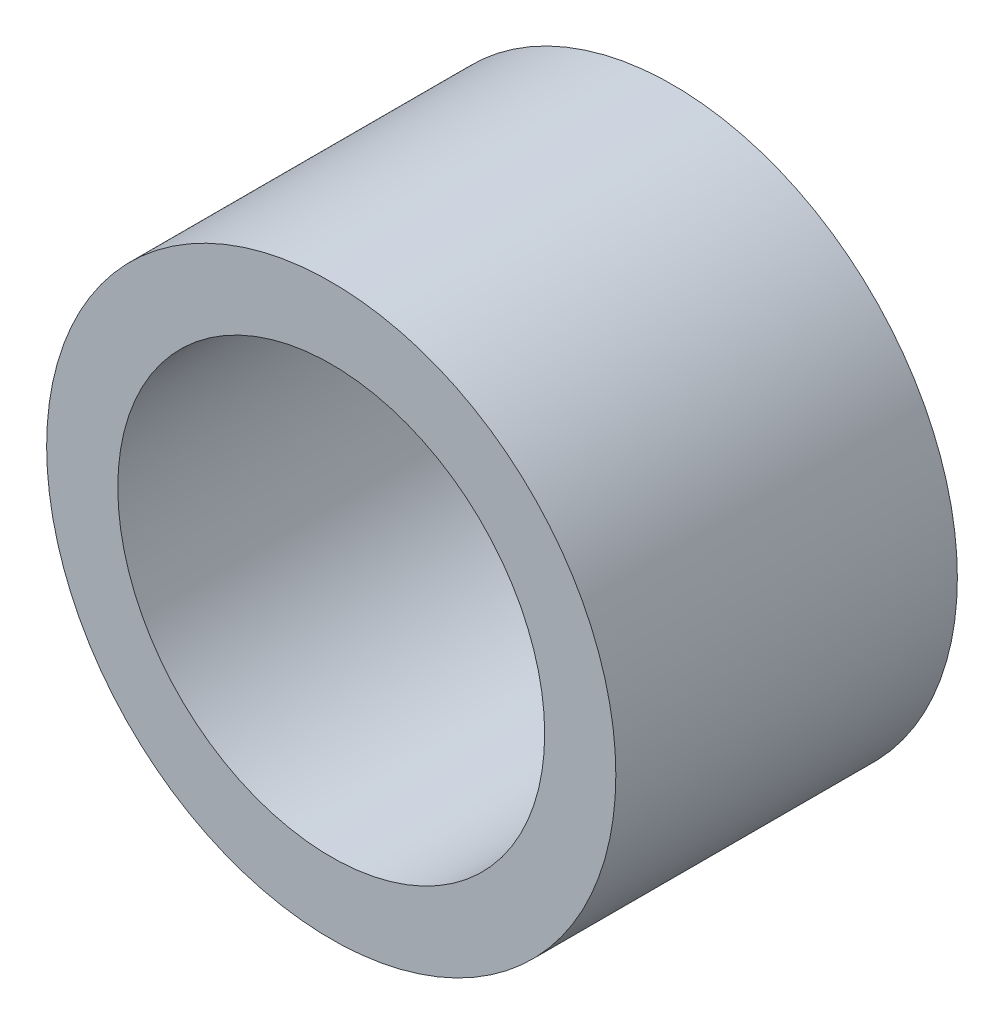
ISO-10303-21;
HEADER;
FILE_DESCRIPTION(('STEP AP214'),'2;1');
FILE_NAME('part.step','',(''),(''),'','','');
FILE_SCHEMA(('AUTOMOTIVE_DESIGN { 1 0 10303 214 1 1 1 1 }'));
ENDSEC;
DATA;
#1=APPLICATION_CONTEXT('core data for automotive mechanical design processes');
#2=APPLICATION_PROTOCOL_DEFINITION('international standard','automotive_design',2000,#1);
#3=PRODUCT_CONTEXT('',#1,'mechanical');
#4=PRODUCT('Part','Part','',(#3));
#5=PRODUCT_RELATED_PRODUCT_CATEGORY('part','',(#4));
#6=PRODUCT_DEFINITION_FORMATION('','',#4);
#7=PRODUCT_DEFINITION_CONTEXT('part definition',#1,'design');
#8=PRODUCT_DEFINITION('design','',#6,#7);
#9=PRODUCT_DEFINITION_SHAPE('','',#8);
#10=(LENGTH_UNIT() NAMED_UNIT(*) SI_UNIT(.MILLI.,.METRE.));
#11=(NAMED_UNIT(*) PLANE_ANGLE_UNIT() SI_UNIT($,.RADIAN.));
#12=(NAMED_UNIT(*) SI_UNIT($,.STERADIAN.) SOLID_ANGLE_UNIT());
#13=UNCERTAINTY_MEASURE_WITH_UNIT(LENGTH_MEASURE(1.E-05),#10,'distance_accuracy_value','');
#14=(GEOMETRIC_REPRESENTATION_CONTEXT(3) GLOBAL_UNCERTAINTY_ASSIGNED_CONTEXT((#13)) GLOBAL_UNIT_ASSIGNED_CONTEXT((#10,
#11,#12)) REPRESENTATION_CONTEXT('',''));
#15=CARTESIAN_POINT('',(0.,0.,0.));
#16=DIRECTION('',(0.,0.,1.));
#17=DIRECTION('',(1.,0.,0.));
#18=AXIS2_PLACEMENT_3D('',#15,#16,#17);
#19=CARTESIAN_POINT('',(0.,0.,5.08));
#20=DIRECTION('',(0.,0.,1.));
#21=DIRECTION('',(1.,0.,0.));
#22=AXIS2_PLACEMENT_3D('',#19,#20,#21);
#23=PLANE('',#22);
#24=CARTESIAN_POINT('',(0.,0.,5.08));
#25=DIRECTION('',(0.,0.,1.));
#26=DIRECTION('',(1.,0.,0.));
#27=AXIS2_PLACEMENT_3D('',#24,#25,#26);
#28=CIRCLE('',#27,4.23333333333333);
#29=CARTESIAN_POINT('',(4.23333333333333,0.,5.08));
#30=VERTEX_POINT('',#29);
#31=EDGE_CURVE('E10',#30,#30,#28,.T.);
#32=ORIENTED_EDGE('',*,*,#31,.T.);
#33=EDGE_LOOP('',(#32));
#34=FACE_BOUND('',#33,.T.);
#35=CARTESIAN_POINT('',(0.,0.,5.08));
#36=DIRECTION('',(0.,0.,1.));
#37=DIRECTION('',(1.,0.,0.));
#38=AXIS2_PLACEMENT_3D('',#35,#36,#37);
#39=CIRCLE('',#38,3.175);
#40=CARTESIAN_POINT('',(3.175,0.,5.08));
#41=VERTEX_POINT('',#40);
#42=EDGE_CURVE('E45',#41,#41,#39,.T.);
#43=ORIENTED_EDGE('',*,*,#42,.F.);
#44=EDGE_LOOP('',(#43));
#45=FACE_BOUND('',#44,.T.);
#46=ADVANCED_FACE('F34',(#34,#45),#23,.T.);
#47=CARTESIAN_POINT('',(0.,0.,0.));
#48=DIRECTION('',(0.,0.,1.));
#49=DIRECTION('',(1.,0.,0.));
#50=AXIS2_PLACEMENT_3D('',#47,#48,#49);
#51=PLANE('',#50);
#52=CARTESIAN_POINT('',(0.,0.,0.));
#53=DIRECTION('',(0.,0.,1.));
#54=DIRECTION('',(1.,0.,0.));
#55=AXIS2_PLACEMENT_3D('',#52,#53,#54);
#56=CIRCLE('',#55,4.23333333333333);
#57=CARTESIAN_POINT('',(4.23333333333333,0.,0.));
#58=VERTEX_POINT('',#57);
#59=EDGE_CURVE('E38',#58,#58,#56,.T.);
#60=ORIENTED_EDGE('',*,*,#59,.F.);
#61=EDGE_LOOP('',(#60));
#62=FACE_BOUND('',#61,.T.);
#63=CARTESIAN_POINT('',(0.,0.,0.));
#64=DIRECTION('',(0.,0.,1.));
#65=DIRECTION('',(1.,0.,0.));
#66=AXIS2_PLACEMENT_3D('',#63,#64,#65);
#67=CIRCLE('',#66,3.175);
#68=CARTESIAN_POINT('',(3.175,0.,0.));
#69=VERTEX_POINT('',#68);
#70=EDGE_CURVE('E47',#69,#69,#67,.T.);
#71=ORIENTED_EDGE('',*,*,#70,.T.);
#72=EDGE_LOOP('',(#71));
#73=FACE_BOUND('',#72,.T.);
#74=ADVANCED_FACE('F57',(#62,#73),#51,.F.);
#75=CARTESIAN_POINT('',(0.,0.,5.08));
#76=DIRECTION('',(0.,0.,-1.));
#77=DIRECTION('',(-1.,0.,0.));
#78=AXIS2_PLACEMENT_3D('',#75,#76,#77);
#79=CYLINDRICAL_SURFACE('',#78,4.23333333333333);
#80=ORIENTED_EDGE('',*,*,#31,.F.);
#81=EDGE_LOOP('',(#80));
#82=FACE_BOUND('',#81,.T.);
#83=ORIENTED_EDGE('',*,*,#59,.T.);
#84=EDGE_LOOP('',(#83));
#85=FACE_BOUND('',#84,.T.);
#86=ADVANCED_FACE('F36',(#82,#85),#79,.T.);
#87=CARTESIAN_POINT('',(0.,0.,5.08));
#88=DIRECTION('',(0.,0.,-1.));
#89=DIRECTION('',(-1.,0.,0.));
#90=AXIS2_PLACEMENT_3D('',#87,#88,#89);
#91=CYLINDRICAL_SURFACE('',#90,3.175);
#92=ORIENTED_EDGE('',*,*,#42,.T.);
#93=EDGE_LOOP('',(#92));
#94=FACE_BOUND('',#93,.T.);
#95=ORIENTED_EDGE('',*,*,#70,.F.);
#96=EDGE_LOOP('',(#95));
#97=FACE_BOUND('',#96,.T.);
#98=ADVANCED_FACE('F53',(#94,#97),#91,.F.);
#99=CLOSED_SHELL('',(#46,#74,#86,#98));
#100=MANIFOLD_SOLID_BREP('B2',#99);
#101=ADVANCED_BREP_SHAPE_REPRESENTATION('',(#18,#100),#14);
#102=SHAPE_DEFINITION_REPRESENTATION(#9,#101);
ENDSEC;
END-ISO-10303-21;
